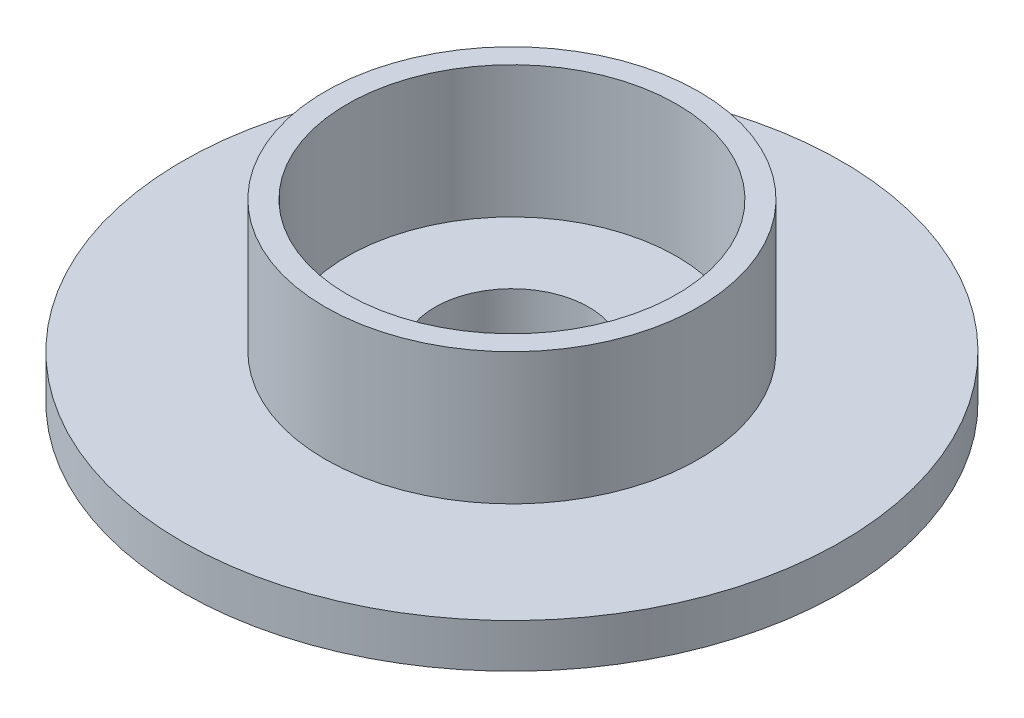
ISO-10303-21;
HEADER;
FILE_DESCRIPTION(('STEP AP214'),'2;1');
FILE_NAME('part.step','',(''),(''),'','','');
FILE_SCHEMA(('AUTOMOTIVE_DESIGN { 1 0 10303 214 1 1 1 1 }'));
ENDSEC;
DATA;
#1=APPLICATION_CONTEXT('core data for automotive mechanical design processes');
#2=APPLICATION_PROTOCOL_DEFINITION('international standard','automotive_design',2000,#1);
#3=PRODUCT_CONTEXT('',#1,'mechanical');
#4=PRODUCT('Part','Part','',(#3));
#5=PRODUCT_RELATED_PRODUCT_CATEGORY('part','',(#4));
#6=PRODUCT_DEFINITION_FORMATION('','',#4);
#7=PRODUCT_DEFINITION_CONTEXT('part definition',#1,'design');
#8=PRODUCT_DEFINITION('design','',#6,#7);
#9=PRODUCT_DEFINITION_SHAPE('','',#8);
#10=(LENGTH_UNIT() NAMED_UNIT(*) SI_UNIT(.MILLI.,.METRE.));
#11=(NAMED_UNIT(*) PLANE_ANGLE_UNIT() SI_UNIT($,.RADIAN.));
#12=(NAMED_UNIT(*) SI_UNIT($,.STERADIAN.) SOLID_ANGLE_UNIT());
#13=UNCERTAINTY_MEASURE_WITH_UNIT(LENGTH_MEASURE(1.E-05),#10,'distance_accuracy_value','');
#14=(GEOMETRIC_REPRESENTATION_CONTEXT(3) GLOBAL_UNCERTAINTY_ASSIGNED_CONTEXT((#13)) GLOBAL_UNIT_ASSIGNED_CONTEXT((#10,
#11,#12)) REPRESENTATION_CONTEXT('',''));
#15=CARTESIAN_POINT('',(0.,0.,0.));
#16=DIRECTION('',(0.,0.,1.));
#17=DIRECTION('',(1.,0.,0.));
#18=AXIS2_PLACEMENT_3D('',#15,#16,#17);
#19=CARTESIAN_POINT('',(-26.5502342121883,10.,-13.5075771442659));
#20=DIRECTION('',(0.,-1.,0.));
#21=DIRECTION('',(0.,0.,-1.));
#22=AXIS2_PLACEMENT_3D('',#19,#20,#21);
#23=CYLINDRICAL_SURFACE('',#22,75.);
#24=CARTESIAN_POINT('',(-26.5502342121883,10.,-13.5075771442659));
#25=DIRECTION('',(0.,1.,0.));
#26=DIRECTION('',(0.,0.,1.));
#27=AXIS2_PLACEMENT_3D('',#24,#25,#26);
#28=CIRCLE('',#27,75.);
#29=CARTESIAN_POINT('',(-26.5502342121883,10.,61.4924228557341));
#30=VERTEX_POINT('',#29);
#31=EDGE_CURVE('E43',#30,#30,#28,.T.);
#32=ORIENTED_EDGE('',*,*,#31,.F.);
#33=EDGE_LOOP('',(#32));
#34=FACE_BOUND('',#33,.T.);
#35=CARTESIAN_POINT('',(-26.5502342121883,0.,-13.5075771442659));
#36=DIRECTION('',(0.,1.,0.));
#37=DIRECTION('',(0.,0.,1.));
#38=AXIS2_PLACEMENT_3D('',#35,#36,#37);
#39=CIRCLE('',#38,75.);
#40=CARTESIAN_POINT('',(-26.5502342121883,0.,61.4924228557341));
#41=VERTEX_POINT('',#40);
#42=EDGE_CURVE('E47',#41,#41,#39,.T.);
#43=ORIENTED_EDGE('',*,*,#42,.T.);
#44=EDGE_LOOP('',(#43));
#45=FACE_BOUND('',#44,.T.);
#46=ADVANCED_FACE('F37',(#34,#45),#23,.T.);
#47=CARTESIAN_POINT('',(-26.5502342121883,10.,-13.5075771442659));
#48=DIRECTION('',(0.,1.,0.));
#49=DIRECTION('',(0.,0.,1.));
#50=AXIS2_PLACEMENT_3D('',#47,#48,#49);
#51=PLANE('',#50);
#52=CARTESIAN_POINT('',(-26.5502342121883,10.,-13.5075771442659));
#53=DIRECTION('',(0.,1.,0.));
#54=DIRECTION('',(0.,0.,1.));
#55=AXIS2_PLACEMENT_3D('',#52,#53,#54);
#56=CIRCLE('',#55,42.5);
#57=CARTESIAN_POINT('',(-26.5502342121883,10.,28.9924228557341));
#58=VERTEX_POINT('',#57);
#59=EDGE_CURVE('E54',#58,#58,#56,.T.);
#60=ORIENTED_EDGE('',*,*,#59,.F.);
#61=EDGE_LOOP('',(#60));
#62=FACE_BOUND('',#61,.T.);
#63=ORIENTED_EDGE('',*,*,#31,.T.);
#64=EDGE_LOOP('',(#63));
#65=FACE_BOUND('',#64,.T.);
#66=ADVANCED_FACE('F83',(#62,#65),#51,.T.);
#67=CARTESIAN_POINT('',(-26.5502342121883,0.,-13.5075771442659));
#68=DIRECTION('',(0.,1.,0.));
#69=DIRECTION('',(0.,0.,1.));
#70=AXIS2_PLACEMENT_3D('',#67,#68,#69);
#71=PLANE('',#70);
#72=CARTESIAN_POINT('',(-26.5502342121883,0.,-13.5075771442659));
#73=DIRECTION('',(0.,1.,0.));
#74=DIRECTION('',(0.,0.,1.));
#75=AXIS2_PLACEMENT_3D('',#72,#73,#74);
#76=CIRCLE('',#75,17.5);
#77=CARTESIAN_POINT('',(-26.5502342121883,0.,3.99242285573406));
#78=VERTEX_POINT('',#77);
#79=EDGE_CURVE('E62',#78,#78,#76,.T.);
#80=ORIENTED_EDGE('',*,*,#79,.T.);
#81=EDGE_LOOP('',(#80));
#82=FACE_BOUND('',#81,.T.);
#83=ORIENTED_EDGE('',*,*,#42,.F.);
#84=EDGE_LOOP('',(#83));
#85=FACE_BOUND('',#84,.T.);
#86=ADVANCED_FACE('F69',(#82,#85),#71,.F.);
#87=CARTESIAN_POINT('',(-26.5502342121883,40.,-13.5075771442659));
#88=DIRECTION('',(0.,1.,0.));
#89=DIRECTION('',(0.,0.,1.));
#90=AXIS2_PLACEMENT_3D('',#87,#88,#89);
#91=PLANE('',#90);
#92=CARTESIAN_POINT('',(-26.5502342121883,40.,-13.5075771442659));
#93=DIRECTION('',(0.,1.,0.));
#94=DIRECTION('',(0.,0.,1.));
#95=AXIS2_PLACEMENT_3D('',#92,#93,#94);
#96=CIRCLE('',#95,42.5);
#97=CARTESIAN_POINT('',(-26.5502342121883,40.,28.9924228557341));
#98=VERTEX_POINT('',#97);
#99=EDGE_CURVE('E52',#98,#98,#96,.T.);
#100=ORIENTED_EDGE('',*,*,#99,.T.);
#101=EDGE_LOOP('',(#100));
#102=FACE_BOUND('',#101,.T.);
#103=CARTESIAN_POINT('',(-26.5502342121883,40.,-13.5075771442659));
#104=DIRECTION('',(0.,1.,0.));
#105=DIRECTION('',(0.,0.,1.));
#106=AXIS2_PLACEMENT_3D('',#103,#104,#105);
#107=CIRCLE('',#106,37.5);
#108=CARTESIAN_POINT('',(-26.5502342121883,40.,23.9924228557341));
#109=VERTEX_POINT('',#108);
#110=EDGE_CURVE('E57',#109,#109,#107,.T.);
#111=ORIENTED_EDGE('',*,*,#110,.F.);
#112=EDGE_LOOP('',(#111));
#113=FACE_BOUND('',#112,.T.);
#114=ADVANCED_FACE('F100',(#102,#113),#91,.T.);
#115=CARTESIAN_POINT('',(-26.5502342121883,40.,-13.5075771442659));
#116=DIRECTION('',(0.,-1.,0.));
#117=DIRECTION('',(0.,0.,-1.));
#118=AXIS2_PLACEMENT_3D('',#115,#116,#117);
#119=CYLINDRICAL_SURFACE('',#118,42.5);
#120=ORIENTED_EDGE('',*,*,#99,.F.);
#121=EDGE_LOOP('',(#120));
#122=FACE_BOUND('',#121,.T.);
#123=ORIENTED_EDGE('',*,*,#59,.T.);
#124=EDGE_LOOP('',(#123));
#125=FACE_BOUND('',#124,.T.);
#126=ADVANCED_FACE('F87',(#122,#125),#119,.T.);
#127=CARTESIAN_POINT('',(-26.5502342121883,40.,-13.5075771442659));
#128=DIRECTION('',(0.,-1.,0.));
#129=DIRECTION('',(0.,0.,-1.));
#130=AXIS2_PLACEMENT_3D('',#127,#128,#129);
#131=CYLINDRICAL_SURFACE('',#130,37.5);
#132=ORIENTED_EDGE('',*,*,#110,.T.);
#133=EDGE_LOOP('',(#132));
#134=FACE_BOUND('',#133,.T.);
#135=CARTESIAN_POINT('',(-26.5502342121883,10.,-13.5075771442659));
#136=DIRECTION('',(0.,1.,0.));
#137=DIRECTION('',(0.,0.,1.));
#138=AXIS2_PLACEMENT_3D('',#135,#136,#137);
#139=CIRCLE('',#138,37.5);
#140=CARTESIAN_POINT('',(-26.5502342121883,10.,23.9924228557341));
#141=VERTEX_POINT('',#140);
#142=EDGE_CURVE('E11',#141,#141,#139,.F.);
#143=ORIENTED_EDGE('',*,*,#142,.T.);
#144=EDGE_LOOP('',(#143));
#145=FACE_BOUND('',#144,.T.);
#146=ADVANCED_FACE('F81',(#134,#145),#131,.F.);
#147=CARTESIAN_POINT('',(-26.5502342121883,10.,-13.5075771442659));
#148=DIRECTION('',(0.,1.,0.));
#149=DIRECTION('',(0.,0.,1.));
#150=AXIS2_PLACEMENT_3D('',#147,#148,#149);
#151=CIRCLE('',#150,17.5);
#152=CARTESIAN_POINT('',(-26.5502342121883,10.,3.99242285573406));
#153=VERTEX_POINT('',#152);
#154=EDGE_CURVE('E63',#153,#153,#151,.T.);
#155=ORIENTED_EDGE('',*,*,#154,.F.);
#156=EDGE_LOOP('',(#155));
#157=FACE_BOUND('',#156,.T.);
#158=ORIENTED_EDGE('',*,*,#142,.F.);
#159=EDGE_LOOP('',(#158));
#160=FACE_BOUND('',#159,.T.);
#161=ADVANCED_FACE('F75',(#157,#160),#51,.T.);
#162=CARTESIAN_POINT('',(-26.5502342121883,0.,-13.5075771442659));
#163=DIRECTION('',(0.,1.,0.));
#164=DIRECTION('',(0.,0.,1.));
#165=AXIS2_PLACEMENT_3D('',#162,#163,#164);
#166=CYLINDRICAL_SURFACE('',#165,17.5);
#167=ORIENTED_EDGE('',*,*,#79,.F.);
#168=EDGE_LOOP('',(#167));
#169=FACE_BOUND('',#168,.T.);
#170=ORIENTED_EDGE('',*,*,#154,.T.);
#171=EDGE_LOOP('',(#170));
#172=FACE_BOUND('',#171,.T.);
#173=ADVANCED_FACE('F72',(#169,#172),#166,.F.);
#174=CLOSED_SHELL('',(#46,#66,#86,#114,#126,#146,#161,#173));
#175=MANIFOLD_SOLID_BREP('B2',#174);
#176=ADVANCED_BREP_SHAPE_REPRESENTATION('',(#18,#175),#14);
#177=SHAPE_DEFINITION_REPRESENTATION(#9,#176);
ENDSEC;
END-ISO-10303-21;
